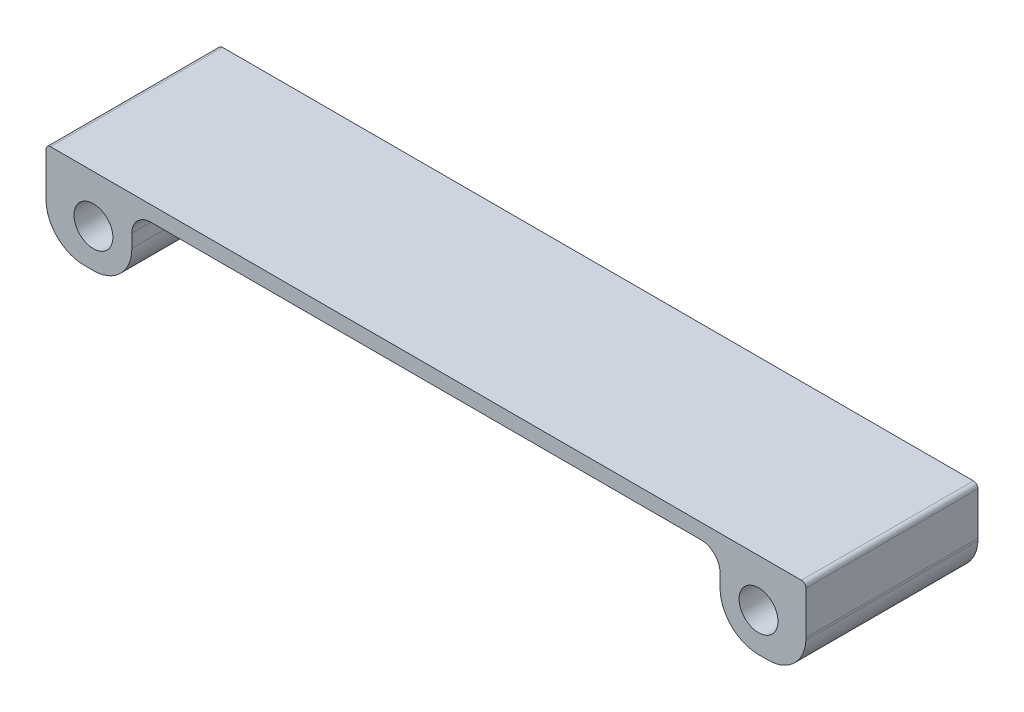
ISO-10303-21;
HEADER;
FILE_DESCRIPTION(('STEP AP214'),'2;1');
FILE_NAME('part.step','',(''),(''),'','','');
FILE_SCHEMA(('AUTOMOTIVE_DESIGN { 1 0 10303 214 1 1 1 1 }'));
ENDSEC;
DATA;
#1=APPLICATION_CONTEXT('core data for automotive mechanical design processes');
#2=APPLICATION_PROTOCOL_DEFINITION('international standard','automotive_design',2000,#1);
#3=PRODUCT_CONTEXT('',#1,'mechanical');
#4=PRODUCT('Part','Part','',(#3));
#5=PRODUCT_RELATED_PRODUCT_CATEGORY('part','',(#4));
#6=PRODUCT_DEFINITION_FORMATION('','',#4);
#7=PRODUCT_DEFINITION_CONTEXT('part definition',#1,'design');
#8=PRODUCT_DEFINITION('design','',#6,#7);
#9=PRODUCT_DEFINITION_SHAPE('','',#8);
#10=(LENGTH_UNIT() NAMED_UNIT(*) SI_UNIT(.MILLI.,.METRE.));
#11=(NAMED_UNIT(*) PLANE_ANGLE_UNIT() SI_UNIT($,.RADIAN.));
#12=(NAMED_UNIT(*) SI_UNIT($,.STERADIAN.) SOLID_ANGLE_UNIT());
#13=UNCERTAINTY_MEASURE_WITH_UNIT(LENGTH_MEASURE(1.E-05),#10,'distance_accuracy_value','');
#14=(GEOMETRIC_REPRESENTATION_CONTEXT(3) GLOBAL_UNCERTAINTY_ASSIGNED_CONTEXT((#13)) GLOBAL_UNIT_ASSIGNED_CONTEXT((#10,
#11,#12)) REPRESENTATION_CONTEXT('',''));
#15=CARTESIAN_POINT('',(0.,0.,0.));
#16=DIRECTION('',(0.,0.,1.));
#17=DIRECTION('',(1.,0.,0.));
#18=AXIS2_PLACEMENT_3D('',#15,#16,#17);
#19=CARTESIAN_POINT('',(111.1504,-6.4262,28.7528));
#20=DIRECTION('',(0.,1.,0.));
#21=DIRECTION('',(0.,0.,1.));
#22=AXIS2_PLACEMENT_3D('',#19,#20,#21);
#23=PLANE('',#22);
#24=DIRECTION('',(0.,0.,-1.));
#25=VECTOR('',#24,1.);
#26=CARTESIAN_POINT('',(112.723355371268,-6.42619999999999,28.7528));
#27=LINE('',#26,#25);
#28=CARTESIAN_POINT('',(112.723355371268,-6.4262,28.7528));
#29=VERTEX_POINT('',#28);
#30=CARTESIAN_POINT('',(112.723355371268,-6.4262,0.));
#31=VERTEX_POINT('',#30);
#32=EDGE_CURVE('E269',#29,#31,#27,.T.);
#33=ORIENTED_EDGE('',*,*,#32,.F.);
#34=DIRECTION('',(1.,0.,0.));
#35=VECTOR('',#34,1.);
#36=CARTESIAN_POINT('',(111.1504,-6.4262,28.7528));
#37=LINE('',#36,#35);
#38=CARTESIAN_POINT('',(111.1504,-6.4262,28.7528));
#39=VERTEX_POINT('',#38);
#40=EDGE_CURVE('E278',#39,#29,#37,.T.);
#41=ORIENTED_EDGE('',*,*,#40,.F.);
#42=DIRECTION('',(0.,0.,-1.));
#43=VECTOR('',#42,1.);
#44=CARTESIAN_POINT('',(111.1504,-6.42619999999999,28.7528));
#45=LINE('',#44,#43);
#46=CARTESIAN_POINT('',(111.1504,-6.4262,0.));
#47=VERTEX_POINT('',#46);
#48=EDGE_CURVE('E266',#47,#39,#45,.F.);
#49=ORIENTED_EDGE('',*,*,#48,.F.);
#50=DIRECTION('',(1.,0.,0.));
#51=VECTOR('',#50,1.);
#52=CARTESIAN_POINT('',(111.1504,-6.4262,0.));
#53=LINE('',#52,#51);
#54=EDGE_CURVE('E275',#31,#47,#53,.F.);
#55=ORIENTED_EDGE('',*,*,#54,.F.);
#56=EDGE_LOOP('',(#33,#41,#49,#55));
#57=FACE_BOUND('',#56,.T.);
#58=ADVANCED_FACE('F16',(#57),#23,.F.);
#59=CARTESIAN_POINT('',(0.,-6.4262,28.7528));
#60=DIRECTION('',(0.,1.,0.));
#61=DIRECTION('',(0.,0.,1.));
#62=AXIS2_PLACEMENT_3D('',#59,#60,#61);
#63=PLANE('',#62);
#64=DIRECTION('',(0.,0.,-1.));
#65=VECTOR('',#64,1.);
#66=CARTESIAN_POINT('',(-1.57295537126772,-6.4262,28.7528));
#67=LINE('',#66,#65);
#68=CARTESIAN_POINT('',(-1.57295537126772,-6.4262,0.));
#69=VERTEX_POINT('',#68);
#70=CARTESIAN_POINT('',(-1.57295537126772,-6.4262,28.7528));
#71=VERTEX_POINT('',#70);
#72=EDGE_CURVE('E152',#69,#71,#67,.F.);
#73=ORIENTED_EDGE('',*,*,#72,.F.);
#74=DIRECTION('',(1.,0.,0.));
#75=VECTOR('',#74,1.);
#76=CARTESIAN_POINT('',(0.,-6.4262,0.));
#77=LINE('',#76,#75);
#78=CARTESIAN_POINT('',(0.,-6.4262,0.));
#79=VERTEX_POINT('',#78);
#80=EDGE_CURVE('E158',#79,#69,#77,.F.);
#81=ORIENTED_EDGE('',*,*,#80,.F.);
#82=DIRECTION('',(0.,0.,-1.));
#83=VECTOR('',#82,1.);
#84=CARTESIAN_POINT('',(0.,-6.4262,28.7528));
#85=LINE('',#84,#83);
#86=CARTESIAN_POINT('',(0.,-6.4262,28.7528));
#87=VERTEX_POINT('',#86);
#88=EDGE_CURVE('E153',#87,#79,#85,.T.);
#89=ORIENTED_EDGE('',*,*,#88,.F.);
#90=DIRECTION('',(1.,0.,0.));
#91=VECTOR('',#90,1.);
#92=CARTESIAN_POINT('',(0.,-6.4262,28.7528));
#93=LINE('',#92,#91);
#94=EDGE_CURVE('E144',#71,#87,#93,.T.);
#95=ORIENTED_EDGE('',*,*,#94,.F.);
#96=EDGE_LOOP('',(#73,#81,#89,#95));
#97=FACE_BOUND('',#96,.T.);
#98=ADVANCED_FACE('F498',(#97),#63,.F.);
#99=CARTESIAN_POINT('',(0.,0.,28.7528));
#100=DIRECTION('',(0.,0.,-1.));
#101=DIRECTION('',(-1.,0.,0.));
#102=AXIS2_PLACEMENT_3D('',#99,#100,#101);
#103=CYLINDRICAL_SURFACE('',#102,7.92479999999999);
#104=CARTESIAN_POINT('',(0.,0.,28.7528));
#105=DIRECTION('',(0.,0.,-1.));
#106=DIRECTION('',(-1.,0.,0.));
#107=AXIS2_PLACEMENT_3D('',#104,#105,#106);
#108=CIRCLE('',#107,7.92479999999999);
#109=CARTESIAN_POINT('',(-7.91551735218598,-0.38345806451614,28.7528));
#110=VERTEX_POINT('',#109);
#111=CARTESIAN_POINT('',(-7.9248,0.,28.7528));
#112=VERTEX_POINT('',#111);
#113=EDGE_CURVE('E143',#110,#112,#108,.T.);
#114=ORIENTED_EDGE('',*,*,#113,.T.);
#115=DIRECTION('',(0.,0.,1.));
#116=VECTOR('',#115,1.);
#117=CARTESIAN_POINT('',(-7.9248,0.,28.7528));
#118=LINE('',#117,#116);
#119=CARTESIAN_POINT('',(-7.9248,0.,0.));
#120=VERTEX_POINT('',#119);
#121=EDGE_CURVE('E141',#112,#120,#118,.F.);
#122=ORIENTED_EDGE('',*,*,#121,.T.);
#123=CARTESIAN_POINT('',(0.,0.,0.));
#124=DIRECTION('',(0.,0.,-1.));
#125=DIRECTION('',(-1.,0.,0.));
#126=AXIS2_PLACEMENT_3D('',#123,#124,#125);
#127=CIRCLE('',#126,7.92479999999999);
#128=CARTESIAN_POINT('',(-7.91551735218598,-0.38345806451614,0.));
#129=VERTEX_POINT('',#128);
#130=EDGE_CURVE('E19',#120,#129,#127,.F.);
#131=ORIENTED_EDGE('',*,*,#130,.T.);
#132=DIRECTION('',(0.,0.,-1.));
#133=VECTOR('',#132,1.);
#134=CARTESIAN_POINT('',(-7.91551735218598,-0.383458064516141,28.7528));
#135=LINE('',#134,#133);
#136=EDGE_CURVE('E138',#110,#129,#135,.T.);
#137=ORIENTED_EDGE('',*,*,#136,.F.);
#138=EDGE_LOOP('',(#114,#122,#131,#137));
#139=FACE_BOUND('',#138,.T.);
#140=ADVANCED_FACE('F137',(#139),#103,.T.);
#141=CARTESIAN_POINT('',(111.1504,0.,28.7528));
#142=DIRECTION('',(0.,0.,-1.));
#143=DIRECTION('',(-1.,0.,0.));
#144=AXIS2_PLACEMENT_3D('',#141,#142,#143);
#145=CYLINDRICAL_SURFACE('',#144,7.9248);
#146=CARTESIAN_POINT('',(111.1504,0.,0.));
#147=DIRECTION('',(0.,0.,-1.));
#148=DIRECTION('',(-1.,0.,0.));
#149=AXIS2_PLACEMENT_3D('',#146,#147,#148);
#150=CIRCLE('',#149,7.9248);
#151=CARTESIAN_POINT('',(119.065917352186,-0.383458064516131,0.));
#152=VERTEX_POINT('',#151);
#153=CARTESIAN_POINT('',(119.0752,0.,0.));
#154=VERTEX_POINT('',#153);
#155=EDGE_CURVE('E214',#152,#154,#150,.F.);
#156=ORIENTED_EDGE('',*,*,#155,.T.);
#157=DIRECTION('',(0.,0.,1.));
#158=VECTOR('',#157,1.);
#159=CARTESIAN_POINT('',(119.0752,0.,28.7528));
#160=LINE('',#159,#158);
#161=CARTESIAN_POINT('',(119.0752,0.,28.7528));
#162=VERTEX_POINT('',#161);
#163=EDGE_CURVE('E225',#154,#162,#160,.T.);
#164=ORIENTED_EDGE('',*,*,#163,.T.);
#165=CARTESIAN_POINT('',(111.1504,0.,28.7528));
#166=DIRECTION('',(0.,0.,-1.));
#167=DIRECTION('',(-1.,0.,0.));
#168=AXIS2_PLACEMENT_3D('',#165,#166,#167);
#169=CIRCLE('',#168,7.9248);
#170=CARTESIAN_POINT('',(119.065917352186,-0.383458064516131,28.7528));
#171=VERTEX_POINT('',#170);
#172=EDGE_CURVE('E217',#162,#171,#169,.T.);
#173=ORIENTED_EDGE('',*,*,#172,.T.);
#174=DIRECTION('',(0.,0.,-1.));
#175=VECTOR('',#174,1.);
#176=CARTESIAN_POINT('',(119.065917352186,-0.38345806451613,28.7528));
#177=LINE('',#176,#175);
#178=EDGE_CURVE('E216',#152,#171,#177,.F.);
#179=ORIENTED_EDGE('',*,*,#178,.F.);
#180=EDGE_LOOP('',(#156,#164,#173,#179));
#181=FACE_BOUND('',#180,.T.);
#182=ADVANCED_FACE('F479',(#181),#145,.T.);
#183=CARTESIAN_POINT('',(112.723355371268,-0.0762000000000002,28.7528));
#184=DIRECTION('',(0.,0.,-1.));
#185=DIRECTION('',(-1.,0.,0.));
#186=AXIS2_PLACEMENT_3D('',#183,#184,#185);
#187=CYLINDRICAL_SURFACE('',#186,6.34999999999999);
#188=CARTESIAN_POINT('',(112.723355371268,-0.0762000000000002,28.7528));
#189=DIRECTION('',(0.,0.,-1.));
#190=DIRECTION('',(-1.,0.,0.));
#191=AXIS2_PLACEMENT_3D('',#188,#189,#190);
#192=CIRCLE('',#191,6.34999999999999);
#193=EDGE_CURVE('E186',#171,#29,#192,.T.);
#194=ORIENTED_EDGE('',*,*,#193,.T.);
#195=ORIENTED_EDGE('',*,*,#32,.T.);
#196=CARTESIAN_POINT('',(112.723355371268,-0.0762000000000002,0.));
#197=DIRECTION('',(0.,0.,-1.));
#198=DIRECTION('',(-1.,0.,0.));
#199=AXIS2_PLACEMENT_3D('',#196,#197,#198);
#200=CIRCLE('',#199,6.34999999999999);
#201=EDGE_CURVE('E177',#152,#31,#200,.T.);
#202=ORIENTED_EDGE('',*,*,#201,.F.);
#203=ORIENTED_EDGE('',*,*,#178,.T.);
#204=EDGE_LOOP('',(#194,#195,#202,#203));
#205=FACE_BOUND('',#204,.T.);
#206=ADVANCED_FACE('F469',(#205),#187,.T.);
#207=CARTESIAN_POINT('',(111.1504,0.,28.7528));
#208=DIRECTION('',(0.,0.,-1.));
#209=DIRECTION('',(-1.,0.,0.));
#210=AXIS2_PLACEMENT_3D('',#207,#208,#209);
#211=CYLINDRICAL_SURFACE('',#210,6.42619999999999);
#212=CARTESIAN_POINT('',(111.1504,0.,28.7528));
#213=DIRECTION('',(0.,0.,-1.));
#214=DIRECTION('',(-1.,0.,0.));
#215=AXIS2_PLACEMENT_3D('',#212,#213,#214);
#216=CIRCLE('',#215,6.42619999999999);
#217=CARTESIAN_POINT('',(104.7242,0.,28.7528));
#218=VERTEX_POINT('',#217);
#219=EDGE_CURVE('E207',#39,#218,#216,.T.);
#220=ORIENTED_EDGE('',*,*,#219,.T.);
#221=DIRECTION('',(0.,0.,1.));
#222=VECTOR('',#221,1.);
#223=CARTESIAN_POINT('',(104.7242,0.,28.7528));
#224=LINE('',#223,#222);
#225=CARTESIAN_POINT('',(104.7242,0.,0.));
#226=VERTEX_POINT('',#225);
#227=EDGE_CURVE('E263',#218,#226,#224,.F.);
#228=ORIENTED_EDGE('',*,*,#227,.T.);
#229=CARTESIAN_POINT('',(111.1504,0.,0.));
#230=DIRECTION('',(0.,0.,-1.));
#231=DIRECTION('',(-1.,0.,0.));
#232=AXIS2_PLACEMENT_3D('',#229,#230,#231);
#233=CIRCLE('',#232,6.42619999999999);
#234=EDGE_CURVE('E175',#47,#226,#233,.T.);
#235=ORIENTED_EDGE('',*,*,#234,.F.);
#236=ORIENTED_EDGE('',*,*,#48,.T.);
#237=EDGE_LOOP('',(#220,#228,#235,#236));
#238=FACE_BOUND('',#237,.T.);
#239=ADVANCED_FACE('F459',(#238),#211,.T.);
#240=CARTESIAN_POINT('',(104.7242,0.,28.7528));
#241=DIRECTION('',(1.,0.,0.));
#242=DIRECTION('',(0.,1.,0.));
#243=AXIS2_PLACEMENT_3D('',#240,#241,#242);
#244=PLANE('',#243);
#245=ORIENTED_EDGE('',*,*,#227,.F.);
#246=DIRECTION('',(0.,1.,0.));
#247=VECTOR('',#246,1.);
#248=CARTESIAN_POINT('',(104.7242,-5.6642,28.7528));
#249=LINE('',#248,#247);
#250=CARTESIAN_POINT('',(104.7242,2.2098,28.7528));
#251=VERTEX_POINT('',#250);
#252=EDGE_CURVE('E206',#218,#251,#249,.T.);
#253=ORIENTED_EDGE('',*,*,#252,.T.);
#254=DIRECTION('',(0.,0.,-1.));
#255=VECTOR('',#254,1.);
#256=CARTESIAN_POINT('',(104.7242,2.2098,28.7528));
#257=LINE('',#256,#255);
#258=CARTESIAN_POINT('',(104.7242,2.2098,0.));
#259=VERTEX_POINT('',#258);
#260=EDGE_CURVE('E260',#251,#259,#257,.T.);
#261=ORIENTED_EDGE('',*,*,#260,.T.);
#262=DIRECTION('',(0.,1.,0.));
#263=VECTOR('',#262,1.);
#264=CARTESIAN_POINT('',(104.7242,-5.6642,0.));
#265=LINE('',#264,#263);
#266=EDGE_CURVE('E174',#226,#259,#265,.T.);
#267=ORIENTED_EDGE('',*,*,#266,.F.);
#268=EDGE_LOOP('',(#245,#253,#261,#267));
#269=FACE_BOUND('',#268,.T.);
#270=ADVANCED_FACE('F449',(#269),#244,.F.);
#271=CARTESIAN_POINT('',(101.5492,2.2098,28.7528));
#272=DIRECTION('',(0.,0.,-1.));
#273=DIRECTION('',(-1.,0.,0.));
#274=AXIS2_PLACEMENT_3D('',#271,#272,#273);
#275=CYLINDRICAL_SURFACE('',#274,3.17500000000001);
#276=ORIENTED_EDGE('',*,*,#260,.F.);
#277=CARTESIAN_POINT('',(101.5492,2.2098,28.7528));
#278=DIRECTION('',(0.,0.,-1.));
#279=DIRECTION('',(-1.,0.,0.));
#280=AXIS2_PLACEMENT_3D('',#277,#278,#279);
#281=CIRCLE('',#280,3.17500000000001);
#282=CARTESIAN_POINT('',(101.5492,5.3848,28.7528));
#283=VERTEX_POINT('',#282);
#284=EDGE_CURVE('E203',#251,#283,#281,.F.);
#285=ORIENTED_EDGE('',*,*,#284,.T.);
#286=DIRECTION('',(0.,0.,1.));
#287=VECTOR('',#286,1.);
#288=CARTESIAN_POINT('',(101.5492,5.3848,28.7528));
#289=LINE('',#288,#287);
#290=CARTESIAN_POINT('',(101.5492,5.3848,0.));
#291=VERTEX_POINT('',#290);
#292=EDGE_CURVE('E257',#283,#291,#289,.F.);
#293=ORIENTED_EDGE('',*,*,#292,.T.);
#294=CARTESIAN_POINT('',(101.5492,2.2098,0.));
#295=DIRECTION('',(0.,0.,-1.));
#296=DIRECTION('',(-1.,0.,0.));
#297=AXIS2_PLACEMENT_3D('',#294,#295,#296);
#298=CIRCLE('',#297,3.17500000000001);
#299=EDGE_CURVE('E172',#259,#291,#298,.F.);
#300=ORIENTED_EDGE('',*,*,#299,.F.);
#301=EDGE_LOOP('',(#276,#285,#293,#300));
#302=FACE_BOUND('',#301,.T.);
#303=ADVANCED_FACE('F439',(#302),#275,.F.);
#304=CARTESIAN_POINT('',(101.5492,5.3848,28.7528));
#305=DIRECTION('',(0.,1.,0.));
#306=DIRECTION('',(-1.,0.,0.));
#307=AXIS2_PLACEMENT_3D('',#304,#305,#306);
#308=PLANE('',#307);
#309=ORIENTED_EDGE('',*,*,#292,.F.);
#310=DIRECTION('',(-1.,0.,0.));
#311=VECTOR('',#310,1.);
#312=CARTESIAN_POINT('',(-7.1628,5.3848,28.7528));
#313=LINE('',#312,#311);
#314=CARTESIAN_POINT('',(9.6012,5.38479999999999,28.7528));
#315=VERTEX_POINT('',#314);
#316=EDGE_CURVE('E202',#283,#315,#313,.T.);
#317=ORIENTED_EDGE('',*,*,#316,.T.);
#318=DIRECTION('',(0.,0.,-1.));
#319=VECTOR('',#318,1.);
#320=CARTESIAN_POINT('',(9.6012,5.38479999999999,28.7528));
#321=LINE('',#320,#319);
#322=CARTESIAN_POINT('',(9.6012,5.38479999999999,0.));
#323=VERTEX_POINT('',#322);
#324=EDGE_CURVE('E254',#315,#323,#321,.T.);
#325=ORIENTED_EDGE('',*,*,#324,.T.);
#326=DIRECTION('',(-1.,0.,0.));
#327=VECTOR('',#326,1.);
#328=CARTESIAN_POINT('',(-7.1628,5.3848,0.));
#329=LINE('',#328,#327);
#330=EDGE_CURVE('E171',#291,#323,#329,.T.);
#331=ORIENTED_EDGE('',*,*,#330,.F.);
#332=EDGE_LOOP('',(#309,#317,#325,#331));
#333=FACE_BOUND('',#332,.T.);
#334=ADVANCED_FACE('F429',(#333),#308,.F.);
#335=CARTESIAN_POINT('',(9.6012,2.20979999999999,28.7528));
#336=DIRECTION('',(0.,0.,-1.));
#337=DIRECTION('',(-1.,0.,0.));
#338=AXIS2_PLACEMENT_3D('',#335,#336,#337);
#339=CYLINDRICAL_SURFACE('',#338,3.175);
#340=ORIENTED_EDGE('',*,*,#324,.F.);
#341=CARTESIAN_POINT('',(9.6012,2.20979999999999,28.7528));
#342=DIRECTION('',(0.,0.,-1.));
#343=DIRECTION('',(-1.,0.,0.));
#344=AXIS2_PLACEMENT_3D('',#341,#342,#343);
#345=CIRCLE('',#344,3.175);
#346=CARTESIAN_POINT('',(6.4262,2.20979999999999,28.7528));
#347=VERTEX_POINT('',#346);
#348=EDGE_CURVE('E199',#315,#347,#345,.F.);
#349=ORIENTED_EDGE('',*,*,#348,.T.);
#350=DIRECTION('',(0.,0.,1.));
#351=VECTOR('',#350,1.);
#352=CARTESIAN_POINT('',(6.4262,2.20979999999999,28.7528));
#353=LINE('',#352,#351);
#354=CARTESIAN_POINT('',(6.4262,2.20979999999999,0.));
#355=VERTEX_POINT('',#354);
#356=EDGE_CURVE('E251',#347,#355,#353,.F.);
#357=ORIENTED_EDGE('',*,*,#356,.T.);
#358=CARTESIAN_POINT('',(9.6012,2.20979999999999,0.));
#359=DIRECTION('',(0.,0.,-1.));
#360=DIRECTION('',(-1.,0.,0.));
#361=AXIS2_PLACEMENT_3D('',#358,#359,#360);
#362=CIRCLE('',#361,3.175);
#363=EDGE_CURVE('E169',#323,#355,#362,.F.);
#364=ORIENTED_EDGE('',*,*,#363,.F.);
#365=EDGE_LOOP('',(#340,#349,#357,#364));
#366=FACE_BOUND('',#365,.T.);
#367=ADVANCED_FACE('F419',(#366),#339,.F.);
#368=CARTESIAN_POINT('',(6.4262,0.,28.7528));
#369=DIRECTION('',(-1.,0.,0.));
#370=DIRECTION('',(0.,0.,1.));
#371=AXIS2_PLACEMENT_3D('',#368,#369,#370);
#372=PLANE('',#371);
#373=ORIENTED_EDGE('',*,*,#356,.F.);
#374=DIRECTION('',(0.,1.,0.));
#375=VECTOR('',#374,1.);
#376=CARTESIAN_POINT('',(6.4262,-5.6642,28.7528));
#377=LINE('',#376,#375);
#378=CARTESIAN_POINT('',(6.4262,0.,28.7528));
#379=VERTEX_POINT('',#378);
#380=EDGE_CURVE('E198',#347,#379,#377,.F.);
#381=ORIENTED_EDGE('',*,*,#380,.T.);
#382=DIRECTION('',(0.,0.,-1.));
#383=VECTOR('',#382,1.);
#384=CARTESIAN_POINT('',(6.4262,0.,28.7528));
#385=LINE('',#384,#383);
#386=CARTESIAN_POINT('',(6.4262,0.,0.));
#387=VERTEX_POINT('',#386);
#388=EDGE_CURVE('E249',#387,#379,#385,.F.);
#389=ORIENTED_EDGE('',*,*,#388,.F.);
#390=DIRECTION('',(0.,1.,0.));
#391=VECTOR('',#390,1.);
#392=CARTESIAN_POINT('',(6.4262,-5.6642,0.));
#393=LINE('',#392,#391);
#394=EDGE_CURVE('E164',#355,#387,#393,.F.);
#395=ORIENTED_EDGE('',*,*,#394,.F.);
#396=EDGE_LOOP('',(#373,#381,#389,#395));
#397=FACE_BOUND('',#396,.T.);
#398=ADVANCED_FACE('F409',(#397),#372,.F.);
#399=CARTESIAN_POINT('',(0.,0.,28.7528));
#400=DIRECTION('',(0.,0.,-1.));
#401=DIRECTION('',(-1.,0.,0.));
#402=AXIS2_PLACEMENT_3D('',#399,#400,#401);
#403=CYLINDRICAL_SURFACE('',#402,6.4262);
#404=CARTESIAN_POINT('',(0.,0.,28.7528));
#405=DIRECTION('',(0.,0.,-1.));
#406=DIRECTION('',(-1.,0.,0.));
#407=AXIS2_PLACEMENT_3D('',#404,#405,#406);
#408=CIRCLE('',#407,6.4262);
#409=EDGE_CURVE('E195',#379,#87,#408,.T.);
#410=ORIENTED_EDGE('',*,*,#409,.T.);
#411=ORIENTED_EDGE('',*,*,#88,.T.);
#412=CARTESIAN_POINT('',(0.,0.,0.));
#413=DIRECTION('',(0.,0.,-1.));
#414=DIRECTION('',(-1.,0.,0.));
#415=AXIS2_PLACEMENT_3D('',#412,#413,#414);
#416=CIRCLE('',#415,6.4262);
#417=EDGE_CURVE('E161',#387,#79,#416,.T.);
#418=ORIENTED_EDGE('',*,*,#417,.F.);
#419=ORIENTED_EDGE('',*,*,#388,.T.);
#420=EDGE_LOOP('',(#410,#411,#418,#419));
#421=FACE_BOUND('',#420,.T.);
#422=ADVANCED_FACE('F400',(#421),#403,.T.);
#423=CARTESIAN_POINT('',(-1.57295537126772,-0.0762000000000002,28.7528));
#424=DIRECTION('',(0.,0.,-1.));
#425=DIRECTION('',(-1.,0.,0.));
#426=AXIS2_PLACEMENT_3D('',#423,#424,#425);
#427=CYLINDRICAL_SURFACE('',#426,6.35);
#428=CARTESIAN_POINT('',(-1.57295537126772,-0.0762000000000002,0.));
#429=DIRECTION('',(0.,0.,-1.));
#430=DIRECTION('',(-1.,0.,0.));
#431=AXIS2_PLACEMENT_3D('',#428,#429,#430);
#432=CIRCLE('',#431,6.35);
#433=EDGE_CURVE('E149',#69,#129,#432,.T.);
#434=ORIENTED_EDGE('',*,*,#433,.F.);
#435=ORIENTED_EDGE('',*,*,#72,.T.);
#436=CARTESIAN_POINT('',(-1.57295537126772,-0.0762000000000002,28.7528));
#437=DIRECTION('',(0.,0.,-1.));
#438=DIRECTION('',(-1.,0.,0.));
#439=AXIS2_PLACEMENT_3D('',#436,#437,#438);
#440=CIRCLE('',#439,6.35);
#441=EDGE_CURVE('E151',#71,#110,#440,.T.);
#442=ORIENTED_EDGE('',*,*,#441,.T.);
#443=ORIENTED_EDGE('',*,*,#136,.T.);
#444=EDGE_LOOP('',(#434,#435,#442,#443));
#445=FACE_BOUND('',#444,.T.);
#446=ADVANCED_FACE('F147',(#445),#427,.T.);
#447=CARTESIAN_POINT('',(-7.9248,7.16279999999999,28.7528));
#448=DIRECTION('',(1.,0.,0.));
#449=DIRECTION('',(0.,1.,0.));
#450=AXIS2_PLACEMENT_3D('',#447,#448,#449);
#451=PLANE('',#450);
#452=ORIENTED_EDGE('',*,*,#121,.F.);
#453=DIRECTION('',(0.,1.,0.));
#454=VECTOR('',#453,1.);
#455=CARTESIAN_POINT('',(-7.9248,-5.6642,28.7528));
#456=LINE('',#455,#454);
#457=CARTESIAN_POINT('',(-7.9248,7.1628,28.7528));
#458=VERTEX_POINT('',#457);
#459=EDGE_CURVE('E193',#112,#458,#456,.T.);
#460=ORIENTED_EDGE('',*,*,#459,.T.);
#461=DIRECTION('',(0.,0.,-1.));
#462=VECTOR('',#461,1.);
#463=CARTESIAN_POINT('',(-7.9248,7.1628,28.7528));
#464=LINE('',#463,#462);
#465=CARTESIAN_POINT('',(-7.9248,7.1628,0.));
#466=VERTEX_POINT('',#465);
#467=EDGE_CURVE('E182',#466,#458,#464,.F.);
#468=ORIENTED_EDGE('',*,*,#467,.F.);
#469=DIRECTION('',(0.,1.,0.));
#470=VECTOR('',#469,1.);
#471=CARTESIAN_POINT('',(-7.9248,-5.6642,0.));
#472=LINE('',#471,#470);
#473=EDGE_CURVE('E160',#120,#466,#472,.T.);
#474=ORIENTED_EDGE('',*,*,#473,.F.);
#475=EDGE_LOOP('',(#452,#460,#468,#474));
#476=FACE_BOUND('',#475,.T.);
#477=ADVANCED_FACE('F222',(#476),#451,.F.);
#478=CARTESIAN_POINT('',(119.0752,7.16279999999999,28.7528));
#479=DIRECTION('',(-1.,0.,0.));
#480=DIRECTION('',(0.,0.,1.));
#481=AXIS2_PLACEMENT_3D('',#478,#479,#480);
#482=PLANE('',#481);
#483=DIRECTION('',(0.,1.,0.));
#484=VECTOR('',#483,1.);
#485=CARTESIAN_POINT('',(119.0752,-5.6642,0.));
#486=LINE('',#485,#484);
#487=CARTESIAN_POINT('',(119.0752,7.1628,0.));
#488=VERTEX_POINT('',#487);
#489=EDGE_CURVE('E286',#488,#154,#486,.F.);
#490=ORIENTED_EDGE('',*,*,#489,.F.);
#491=DIRECTION('',(0.,0.,-1.));
#492=VECTOR('',#491,1.);
#493=CARTESIAN_POINT('',(119.0752,7.16279999999999,28.7528));
#494=LINE('',#493,#492);
#495=CARTESIAN_POINT('',(119.0752,7.1628,28.7528));
#496=VERTEX_POINT('',#495);
#497=EDGE_CURVE('E213',#496,#488,#494,.T.);
#498=ORIENTED_EDGE('',*,*,#497,.F.);
#499=DIRECTION('',(0.,1.,0.));
#500=VECTOR('',#499,1.);
#501=CARTESIAN_POINT('',(119.0752,-5.6642,28.7528));
#502=LINE('',#501,#500);
#503=EDGE_CURVE('E189',#496,#162,#502,.F.);
#504=ORIENTED_EDGE('',*,*,#503,.T.);
#505=ORIENTED_EDGE('',*,*,#163,.F.);
#506=EDGE_LOOP('',(#490,#498,#504,#505));
#507=FACE_BOUND('',#506,.T.);
#508=ADVANCED_FACE('F373',(#507),#482,.F.);
#509=CARTESIAN_POINT('',(0.,0.,28.7528));
#510=DIRECTION('',(0.,0.,-1.));
#511=DIRECTION('',(-1.,0.,0.));
#512=AXIS2_PLACEMENT_3D('',#509,#510,#511);
#513=CYLINDRICAL_SURFACE('',#512,3.2512);
#514=CARTESIAN_POINT('',(0.,0.,28.7528));
#515=DIRECTION('',(0.,0.,-1.));
#516=DIRECTION('',(-1.,0.,0.));
#517=AXIS2_PLACEMENT_3D('',#514,#515,#516);
#518=CIRCLE('',#517,3.2512);
#519=CARTESIAN_POINT('',(-3.2512,0.,28.7528));
#520=VERTEX_POINT('',#519);
#521=EDGE_CURVE('E210',#520,#520,#518,.F.);
#522=ORIENTED_EDGE('',*,*,#521,.T.);
#523=EDGE_LOOP('',(#522));
#524=FACE_BOUND('',#523,.T.);
#525=CARTESIAN_POINT('',(0.,0.,0.));
#526=DIRECTION('',(0.,0.,-1.));
#527=DIRECTION('',(-1.,0.,0.));
#528=AXIS2_PLACEMENT_3D('',#525,#526,#527);
#529=CIRCLE('',#528,3.2512);
#530=CARTESIAN_POINT('',(-3.2512,0.,0.));
#531=VERTEX_POINT('',#530);
#532=EDGE_CURVE('E284',#531,#531,#529,.F.);
#533=ORIENTED_EDGE('',*,*,#532,.F.);
#534=EDGE_LOOP('',(#533));
#535=FACE_BOUND('',#534,.T.);
#536=ADVANCED_FACE('F363',(#524,#535),#513,.F.);
#537=CARTESIAN_POINT('',(111.1504,0.,28.7528));
#538=DIRECTION('',(0.,0.,-1.));
#539=DIRECTION('',(-1.,0.,0.));
#540=AXIS2_PLACEMENT_3D('',#537,#538,#539);
#541=CYLINDRICAL_SURFACE('',#540,3.2512);
#542=CARTESIAN_POINT('',(111.1504,0.,28.7528));
#543=DIRECTION('',(0.,0.,-1.));
#544=DIRECTION('',(-1.,0.,0.));
#545=AXIS2_PLACEMENT_3D('',#542,#543,#544);
#546=CIRCLE('',#545,3.2512);
#547=CARTESIAN_POINT('',(107.8992,0.,28.7528));
#548=VERTEX_POINT('',#547);
#549=EDGE_CURVE('E183',#548,#548,#546,.F.);
#550=ORIENTED_EDGE('',*,*,#549,.T.);
#551=EDGE_LOOP('',(#550));
#552=FACE_BOUND('',#551,.T.);
#553=CARTESIAN_POINT('',(111.1504,0.,0.));
#554=DIRECTION('',(0.,0.,-1.));
#555=DIRECTION('',(-1.,0.,0.));
#556=AXIS2_PLACEMENT_3D('',#553,#554,#555);
#557=CIRCLE('',#556,3.2512);
#558=CARTESIAN_POINT('',(107.8992,0.,0.));
#559=VERTEX_POINT('',#558);
#560=EDGE_CURVE('E280',#559,#559,#557,.F.);
#561=ORIENTED_EDGE('',*,*,#560,.F.);
#562=EDGE_LOOP('',(#561));
#563=FACE_BOUND('',#562,.T.);
#564=ADVANCED_FACE('F354',(#552,#563),#541,.F.);
#565=CARTESIAN_POINT('',(118.3132,7.1628,28.7528));
#566=DIRECTION('',(0.,0.,-1.));
#567=DIRECTION('',(-1.,0.,0.));
#568=AXIS2_PLACEMENT_3D('',#565,#566,#567);
#569=CYLINDRICAL_SURFACE('',#568,0.761999999999999);
#570=CARTESIAN_POINT('',(118.3132,7.1628,28.7528));
#571=DIRECTION('',(0.,0.,-1.));
#572=DIRECTION('',(-1.,0.,0.));
#573=AXIS2_PLACEMENT_3D('',#570,#571,#572);
#574=CIRCLE('',#573,0.761999999999999);
#575=CARTESIAN_POINT('',(118.3132,7.9248,28.7528));
#576=VERTEX_POINT('',#575);
#577=EDGE_CURVE('E190',#576,#496,#574,.T.);
#578=ORIENTED_EDGE('',*,*,#577,.T.);
#579=ORIENTED_EDGE('',*,*,#497,.T.);
#580=CARTESIAN_POINT('',(118.3132,7.1628,0.));
#581=DIRECTION('',(0.,0.,-1.));
#582=DIRECTION('',(-1.,0.,0.));
#583=AXIS2_PLACEMENT_3D('',#580,#581,#582);
#584=CIRCLE('',#583,0.761999999999999);
#585=CARTESIAN_POINT('',(118.3132,7.9248,0.));
#586=VERTEX_POINT('',#585);
#587=EDGE_CURVE('E287',#586,#488,#584,.T.);
#588=ORIENTED_EDGE('',*,*,#587,.F.);
#589=DIRECTION('',(0.,0.,-1.));
#590=VECTOR('',#589,1.);
#591=CARTESIAN_POINT('',(118.3132,7.9248,28.7528));
#592=LINE('',#591,#590);
#593=EDGE_CURVE('E283',#586,#576,#592,.F.);
#594=ORIENTED_EDGE('',*,*,#593,.T.);
#595=EDGE_LOOP('',(#578,#579,#588,#594));
#596=FACE_BOUND('',#595,.T.);
#597=ADVANCED_FACE('F307',(#596),#569,.T.);
#598=CARTESIAN_POINT('',(-7.1628,-5.6642,28.7528));
#599=DIRECTION('',(0.,0.,-1.));
#600=DIRECTION('',(-1.,0.,0.));
#601=AXIS2_PLACEMENT_3D('',#598,#599,#600);
#602=PLANE('',#601);
#603=ORIENTED_EDGE('',*,*,#549,.F.);
#604=EDGE_LOOP('',(#603));
#605=FACE_BOUND('',#604,.T.);
#606=ORIENTED_EDGE('',*,*,#193,.F.);
#607=ORIENTED_EDGE('',*,*,#172,.F.);
#608=ORIENTED_EDGE('',*,*,#503,.F.);
#609=ORIENTED_EDGE('',*,*,#577,.F.);
#610=DIRECTION('',(1.,0.,0.));
#611=VECTOR('',#610,1.);
#612=CARTESIAN_POINT('',(-7.16279999999999,7.9248,28.7528));
#613=LINE('',#612,#611);
#614=CARTESIAN_POINT('',(-7.1628,7.9248,28.7528));
#615=VERTEX_POINT('',#614);
#616=EDGE_CURVE('E297',#576,#615,#613,.F.);
#617=ORIENTED_EDGE('',*,*,#616,.T.);
#618=CARTESIAN_POINT('',(-7.1628,7.1628,28.7528));
#619=DIRECTION('',(0.,0.,-1.));
#620=DIRECTION('',(-1.,0.,0.));
#621=AXIS2_PLACEMENT_3D('',#618,#619,#620);
#622=CIRCLE('',#621,0.762000000000001);
#623=EDGE_CURVE('E180',#458,#615,#622,.T.);
#624=ORIENTED_EDGE('',*,*,#623,.F.);
#625=ORIENTED_EDGE('',*,*,#459,.F.);
#626=ORIENTED_EDGE('',*,*,#113,.F.);
#627=ORIENTED_EDGE('',*,*,#441,.F.);
#628=ORIENTED_EDGE('',*,*,#94,.T.);
#629=ORIENTED_EDGE('',*,*,#409,.F.);
#630=ORIENTED_EDGE('',*,*,#380,.F.);
#631=ORIENTED_EDGE('',*,*,#348,.F.);
#632=ORIENTED_EDGE('',*,*,#316,.F.);
#633=ORIENTED_EDGE('',*,*,#284,.F.);
#634=ORIENTED_EDGE('',*,*,#252,.F.);
#635=ORIENTED_EDGE('',*,*,#219,.F.);
#636=ORIENTED_EDGE('',*,*,#40,.T.);
#637=EDGE_LOOP('',(#606,#607,#608,#609,#617,#624,#625,#626,#627,#628,#629,#630,#631,#632,#633,
#634,#635,#636));
#638=FACE_BOUND('',#637,.T.);
#639=ORIENTED_EDGE('',*,*,#521,.F.);
#640=EDGE_LOOP('',(#639));
#641=FACE_BOUND('',#640,.T.);
#642=ADVANCED_FACE('F228',(#605,#638,#641),#602,.F.);
#643=CARTESIAN_POINT('',(-7.1628,7.1628,28.7528));
#644=DIRECTION('',(0.,0.,-1.));
#645=DIRECTION('',(-1.,0.,0.));
#646=AXIS2_PLACEMENT_3D('',#643,#644,#645);
#647=CYLINDRICAL_SURFACE('',#646,0.762000000000001);
#648=ORIENTED_EDGE('',*,*,#623,.T.);
#649=DIRECTION('',(0.,0.,-1.));
#650=VECTOR('',#649,1.);
#651=CARTESIAN_POINT('',(-7.16279999999999,7.9248,28.7528));
#652=LINE('',#651,#650);
#653=CARTESIAN_POINT('',(-7.1628,7.9248,0.));
#654=VERTEX_POINT('',#653);
#655=EDGE_CURVE('E25',#615,#654,#652,.T.);
#656=ORIENTED_EDGE('',*,*,#655,.T.);
#657=CARTESIAN_POINT('',(-7.1628,7.1628,0.));
#658=DIRECTION('',(0.,0.,-1.));
#659=DIRECTION('',(-1.,0.,0.));
#660=AXIS2_PLACEMENT_3D('',#657,#658,#659);
#661=CIRCLE('',#660,0.762000000000001);
#662=EDGE_CURVE('E33',#466,#654,#661,.T.);
#663=ORIENTED_EDGE('',*,*,#662,.F.);
#664=ORIENTED_EDGE('',*,*,#467,.T.);
#665=EDGE_LOOP('',(#648,#656,#663,#664));
#666=FACE_BOUND('',#665,.T.);
#667=ADVANCED_FACE('F310',(#666),#647,.T.);
#668=CARTESIAN_POINT('',(-7.1628,-5.6642,0.));
#669=DIRECTION('',(0.,0.,-1.));
#670=DIRECTION('',(-1.,0.,0.));
#671=AXIS2_PLACEMENT_3D('',#668,#669,#670);
#672=PLANE('',#671);
#673=ORIENTED_EDGE('',*,*,#560,.T.);
#674=EDGE_LOOP('',(#673));
#675=FACE_BOUND('',#674,.T.);
#676=ORIENTED_EDGE('',*,*,#532,.T.);
#677=EDGE_LOOP('',(#676));
#678=FACE_BOUND('',#677,.T.);
#679=ORIENTED_EDGE('',*,*,#587,.T.);
#680=ORIENTED_EDGE('',*,*,#489,.T.);
#681=ORIENTED_EDGE('',*,*,#155,.F.);
#682=ORIENTED_EDGE('',*,*,#201,.T.);
#683=ORIENTED_EDGE('',*,*,#54,.T.);
#684=ORIENTED_EDGE('',*,*,#234,.T.);
#685=ORIENTED_EDGE('',*,*,#266,.T.);
#686=ORIENTED_EDGE('',*,*,#299,.T.);
#687=ORIENTED_EDGE('',*,*,#330,.T.);
#688=ORIENTED_EDGE('',*,*,#363,.T.);
#689=ORIENTED_EDGE('',*,*,#394,.T.);
#690=ORIENTED_EDGE('',*,*,#417,.T.);
#691=ORIENTED_EDGE('',*,*,#80,.T.);
#692=ORIENTED_EDGE('',*,*,#433,.T.);
#693=ORIENTED_EDGE('',*,*,#130,.F.);
#694=ORIENTED_EDGE('',*,*,#473,.T.);
#695=ORIENTED_EDGE('',*,*,#662,.T.);
#696=DIRECTION('',(1.,0.,0.));
#697=VECTOR('',#696,1.);
#698=CARTESIAN_POINT('',(-7.16279999999999,7.9248,0.));
#699=LINE('',#698,#697);
#700=EDGE_CURVE('E11',#654,#586,#699,.T.);
#701=ORIENTED_EDGE('',*,*,#700,.T.);
#702=EDGE_LOOP('',(#679,#680,#681,#682,#683,#684,#685,#686,#687,#688,#689,#690,#691,#692,#693,
#694,#695,#701));
#703=FACE_BOUND('',#702,.T.);
#704=ADVANCED_FACE('F156',(#675,#678,#703),#672,.T.);
#705=CARTESIAN_POINT('',(-7.16279999999999,7.9248,28.7528));
#706=DIRECTION('',(0.,-1.,0.));
#707=DIRECTION('',(0.,0.,-1.));
#708=AXIS2_PLACEMENT_3D('',#705,#706,#707);
#709=PLANE('',#708);
#710=ORIENTED_EDGE('',*,*,#655,.F.);
#711=ORIENTED_EDGE('',*,*,#616,.F.);
#712=ORIENTED_EDGE('',*,*,#593,.F.);
#713=ORIENTED_EDGE('',*,*,#700,.F.);
#714=EDGE_LOOP('',(#710,#711,#712,#713));
#715=FACE_BOUND('',#714,.T.);
#716=ADVANCED_FACE('F305',(#715),#709,.F.);
#717=CLOSED_SHELL('',(#58,#98,#140,#182,#206,#239,#270,#303,#334,#367,#398,#422,#446,#477,#508,
#536,#564,#597,#642,#667,#704,#716));
#718=MANIFOLD_SOLID_BREP('B1',#717);
#719=ADVANCED_BREP_SHAPE_REPRESENTATION('',(#18,#718),#14);
#720=SHAPE_DEFINITION_REPRESENTATION(#9,#719);
ENDSEC;
END-ISO-10303-21;
